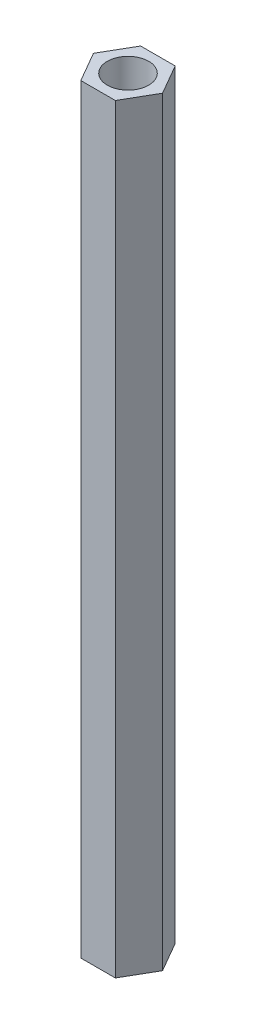
ISO-10303-21;
HEADER;
FILE_DESCRIPTION(('STEP AP214'),'2;1');
FILE_NAME('part.step','',(''),(''),'','','');
FILE_SCHEMA(('AUTOMOTIVE_DESIGN { 1 0 10303 214 1 1 1 1 }'));
ENDSEC;
DATA;
#1=APPLICATION_CONTEXT('core data for automotive mechanical design processes');
#2=APPLICATION_PROTOCOL_DEFINITION('international standard','automotive_design',2000,#1);
#3=PRODUCT_CONTEXT('',#1,'mechanical');
#4=PRODUCT('Part','Part','',(#3));
#5=PRODUCT_RELATED_PRODUCT_CATEGORY('part','',(#4));
#6=PRODUCT_DEFINITION_FORMATION('','',#4);
#7=PRODUCT_DEFINITION_CONTEXT('part definition',#1,'design');
#8=PRODUCT_DEFINITION('design','',#6,#7);
#9=PRODUCT_DEFINITION_SHAPE('','',#8);
#10=(LENGTH_UNIT() NAMED_UNIT(*) SI_UNIT(.MILLI.,.METRE.));
#11=(NAMED_UNIT(*) PLANE_ANGLE_UNIT() SI_UNIT($,.RADIAN.));
#12=(NAMED_UNIT(*) SI_UNIT($,.STERADIAN.) SOLID_ANGLE_UNIT());
#13=UNCERTAINTY_MEASURE_WITH_UNIT(LENGTH_MEASURE(1.E-05),#10,'distance_accuracy_value','');
#14=(GEOMETRIC_REPRESENTATION_CONTEXT(3) GLOBAL_UNCERTAINTY_ASSIGNED_CONTEXT((#13)) GLOBAL_UNIT_ASSIGNED_CONTEXT((#10,
#11,#12)) REPRESENTATION_CONTEXT('',''));
#15=CARTESIAN_POINT('',(0.,0.,0.));
#16=DIRECTION('',(0.,0.,1.));
#17=DIRECTION('',(1.,0.,0.));
#18=AXIS2_PLACEMENT_3D('',#15,#16,#17);
#19=CARTESIAN_POINT('',(0.,55.,0.));
#20=DIRECTION('',(0.,1.,0.));
#21=DIRECTION('',(0.,0.,1.));
#22=AXIS2_PLACEMENT_3D('',#19,#20,#21);
#23=PLANE('',#22);
#24=DIRECTION('',(-0.5,0.,0.866025403784439));
#25=VECTOR('',#24,1.);
#26=CARTESIAN_POINT('',(-1.25,55.,-2.1650635094611));
#27=LINE('',#26,#25);
#28=CARTESIAN_POINT('',(-1.25,55.,-2.1650635094611));
#29=VERTEX_POINT('',#28);
#30=CARTESIAN_POINT('',(-2.5,55.,0.));
#31=VERTEX_POINT('',#30);
#32=EDGE_CURVE('E130',#29,#31,#27,.T.);
#33=ORIENTED_EDGE('',*,*,#32,.T.);
#34=DIRECTION('',(0.5,0.,0.866025403784438));
#35=VECTOR('',#34,1.);
#36=CARTESIAN_POINT('',(-2.5,55.,0.));
#37=LINE('',#36,#35);
#38=CARTESIAN_POINT('',(-1.25,55.,2.1650635094611));
#39=VERTEX_POINT('',#38);
#40=EDGE_CURVE('E88',#31,#39,#37,.T.);
#41=ORIENTED_EDGE('',*,*,#40,.T.);
#42=DIRECTION('',(1.,0.,0.));
#43=VECTOR('',#42,1.);
#44=CARTESIAN_POINT('',(-1.25,55.,2.1650635094611));
#45=LINE('',#44,#43);
#46=CARTESIAN_POINT('',(1.25,55.,2.1650635094611));
#47=VERTEX_POINT('',#46);
#48=EDGE_CURVE('E101',#39,#47,#45,.T.);
#49=ORIENTED_EDGE('',*,*,#48,.T.);
#50=DIRECTION('',(0.5,0.,-0.866025403784439));
#51=VECTOR('',#50,1.);
#52=CARTESIAN_POINT('',(1.25,55.,2.1650635094611));
#53=LINE('',#52,#51);
#54=CARTESIAN_POINT('',(2.5,55.,0.));
#55=VERTEX_POINT('',#54);
#56=EDGE_CURVE('E95',#47,#55,#53,.T.);
#57=ORIENTED_EDGE('',*,*,#56,.T.);
#58=DIRECTION('',(-0.5,0.,-0.866025403784439));
#59=VECTOR('',#58,1.);
#60=CARTESIAN_POINT('',(2.5,55.,0.));
#61=LINE('',#60,#59);
#62=CARTESIAN_POINT('',(1.25,55.,-2.1650635094611));
#63=VERTEX_POINT('',#62);
#64=EDGE_CURVE('E99',#55,#63,#61,.T.);
#65=ORIENTED_EDGE('',*,*,#64,.T.);
#66=DIRECTION('',(-1.,0.,0.));
#67=VECTOR('',#66,1.);
#68=CARTESIAN_POINT('',(1.25,55.,-2.1650635094611));
#69=LINE('',#68,#67);
#70=EDGE_CURVE('E51',#63,#29,#69,.T.);
#71=ORIENTED_EDGE('',*,*,#70,.T.);
#72=EDGE_LOOP('',(#33,#41,#49,#57,#65,#71));
#73=FACE_BOUND('',#72,.T.);
#74=CARTESIAN_POINT('',(0.,55.,0.));
#75=DIRECTION('',(0.,1.,0.));
#76=DIRECTION('',(0.,0.,1.));
#77=AXIS2_PLACEMENT_3D('',#74,#75,#76);
#78=CIRCLE('',#77,1.5);
#79=CARTESIAN_POINT('',(0.,55.,1.5));
#80=VERTEX_POINT('',#79);
#81=EDGE_CURVE('E123',#80,#80,#78,.T.);
#82=ORIENTED_EDGE('',*,*,#81,.F.);
#83=EDGE_LOOP('',(#82));
#84=FACE_BOUND('',#83,.T.);
#85=ADVANCED_FACE('F34',(#73,#84),#23,.T.);
#86=CARTESIAN_POINT('',(0.,0.,0.));
#87=DIRECTION('',(0.,1.,0.));
#88=DIRECTION('',(0.,0.,1.));
#89=AXIS2_PLACEMENT_3D('',#86,#87,#88);
#90=PLANE('',#89);
#91=DIRECTION('',(-0.5,0.,0.866025403784439));
#92=VECTOR('',#91,1.);
#93=CARTESIAN_POINT('',(-1.25,0.,-2.1650635094611));
#94=LINE('',#93,#92);
#95=CARTESIAN_POINT('',(-1.25,0.,-2.1650635094611));
#96=VERTEX_POINT('',#95);
#97=CARTESIAN_POINT('',(-2.5,0.,0.));
#98=VERTEX_POINT('',#97);
#99=EDGE_CURVE('E119',#96,#98,#94,.T.);
#100=ORIENTED_EDGE('',*,*,#99,.F.);
#101=DIRECTION('',(-1.,0.,0.));
#102=VECTOR('',#101,1.);
#103=CARTESIAN_POINT('',(1.25,0.,-2.1650635094611));
#104=LINE('',#103,#102);
#105=CARTESIAN_POINT('',(1.25,0.,-2.1650635094611));
#106=VERTEX_POINT('',#105);
#107=EDGE_CURVE('E80',#106,#96,#104,.T.);
#108=ORIENTED_EDGE('',*,*,#107,.F.);
#109=DIRECTION('',(-0.5,0.,-0.866025403784439));
#110=VECTOR('',#109,1.);
#111=CARTESIAN_POINT('',(2.5,0.,0.));
#112=LINE('',#111,#110);
#113=CARTESIAN_POINT('',(2.5,0.,0.));
#114=VERTEX_POINT('',#113);
#115=EDGE_CURVE('E74',#114,#106,#112,.T.);
#116=ORIENTED_EDGE('',*,*,#115,.F.);
#117=DIRECTION('',(0.5,0.,-0.866025403784439));
#118=VECTOR('',#117,1.);
#119=CARTESIAN_POINT('',(1.25,0.,2.1650635094611));
#120=LINE('',#119,#118);
#121=CARTESIAN_POINT('',(1.25,0.,2.1650635094611));
#122=VERTEX_POINT('',#121);
#123=EDGE_CURVE('E109',#122,#114,#120,.T.);
#124=ORIENTED_EDGE('',*,*,#123,.F.);
#125=DIRECTION('',(1.,0.,0.));
#126=VECTOR('',#125,1.);
#127=CARTESIAN_POINT('',(-1.25,0.,2.1650635094611));
#128=LINE('',#127,#126);
#129=CARTESIAN_POINT('',(-1.25,0.,2.1650635094611));
#130=VERTEX_POINT('',#129);
#131=EDGE_CURVE('E125',#130,#122,#128,.T.);
#132=ORIENTED_EDGE('',*,*,#131,.F.);
#133=DIRECTION('',(0.5,0.,0.866025403784438));
#134=VECTOR('',#133,1.);
#135=CARTESIAN_POINT('',(-2.5,0.,0.));
#136=LINE('',#135,#134);
#137=EDGE_CURVE('E122',#98,#130,#136,.T.);
#138=ORIENTED_EDGE('',*,*,#137,.F.);
#139=EDGE_LOOP('',(#100,#108,#116,#124,#132,#138));
#140=FACE_BOUND('',#139,.T.);
#141=CARTESIAN_POINT('',(0.,0.,0.));
#142=DIRECTION('',(0.,1.,0.));
#143=DIRECTION('',(0.,0.,1.));
#144=AXIS2_PLACEMENT_3D('',#141,#142,#143);
#145=CIRCLE('',#144,1.5);
#146=CARTESIAN_POINT('',(0.,0.,1.5));
#147=VERTEX_POINT('',#146);
#148=EDGE_CURVE('E223',#147,#147,#145,.T.);
#149=ORIENTED_EDGE('',*,*,#148,.T.);
#150=EDGE_LOOP('',(#149));
#151=FACE_BOUND('',#150,.T.);
#152=ADVANCED_FACE('F139',(#140,#151),#90,.F.);
#153=CARTESIAN_POINT('',(-1.25,55.,-2.1650635094611));
#154=DIRECTION('',(0.866025403784439,0.,0.5));
#155=DIRECTION('',(0.5,0.,-0.866025403784439));
#156=AXIS2_PLACEMENT_3D('',#153,#154,#155);
#157=PLANE('',#156);
#158=ORIENTED_EDGE('',*,*,#99,.T.);
#159=DIRECTION('',(0.,-1.,0.));
#160=VECTOR('',#159,1.);
#161=CARTESIAN_POINT('',(-2.5,55.,0.));
#162=LINE('',#161,#160);
#163=EDGE_CURVE('E11',#31,#98,#162,.T.);
#164=ORIENTED_EDGE('',*,*,#163,.F.);
#165=ORIENTED_EDGE('',*,*,#32,.F.);
#166=DIRECTION('',(0.,-1.,0.));
#167=VECTOR('',#166,1.);
#168=CARTESIAN_POINT('',(-1.25,55.,-2.1650635094611));
#169=LINE('',#168,#167);
#170=EDGE_CURVE('E115',#29,#96,#169,.T.);
#171=ORIENTED_EDGE('',*,*,#170,.T.);
#172=EDGE_LOOP('',(#158,#164,#165,#171));
#173=FACE_BOUND('',#172,.T.);
#174=ADVANCED_FACE('F36',(#173),#157,.F.);
#175=CARTESIAN_POINT('',(-2.5,55.,0.));
#176=DIRECTION('',(0.866025403784439,0.,-0.5));
#177=DIRECTION('',(-0.5,0.,-0.866025403784439));
#178=AXIS2_PLACEMENT_3D('',#175,#176,#177);
#179=PLANE('',#178);
#180=ORIENTED_EDGE('',*,*,#137,.T.);
#181=DIRECTION('',(0.,-1.,0.));
#182=VECTOR('',#181,1.);
#183=CARTESIAN_POINT('',(-1.25,55.,2.1650635094611));
#184=LINE('',#183,#182);
#185=EDGE_CURVE('E43',#39,#130,#184,.T.);
#186=ORIENTED_EDGE('',*,*,#185,.F.);
#187=ORIENTED_EDGE('',*,*,#40,.F.);
#188=ORIENTED_EDGE('',*,*,#163,.T.);
#189=EDGE_LOOP('',(#180,#186,#187,#188));
#190=FACE_BOUND('',#189,.T.);
#191=ADVANCED_FACE('F164',(#190),#179,.F.);
#192=CARTESIAN_POINT('',(-1.25,55.,2.1650635094611));
#193=DIRECTION('',(0.,0.,-1.));
#194=DIRECTION('',(-1.,0.,0.));
#195=AXIS2_PLACEMENT_3D('',#192,#193,#194);
#196=PLANE('',#195);
#197=ORIENTED_EDGE('',*,*,#131,.T.);
#198=DIRECTION('',(0.,-1.,0.));
#199=VECTOR('',#198,1.);
#200=CARTESIAN_POINT('',(1.25,55.,2.1650635094611));
#201=LINE('',#200,#199);
#202=EDGE_CURVE('E110',#47,#122,#201,.T.);
#203=ORIENTED_EDGE('',*,*,#202,.F.);
#204=ORIENTED_EDGE('',*,*,#48,.F.);
#205=ORIENTED_EDGE('',*,*,#185,.T.);
#206=EDGE_LOOP('',(#197,#203,#204,#205));
#207=FACE_BOUND('',#206,.T.);
#208=ADVANCED_FACE('F136',(#207),#196,.F.);
#209=CARTESIAN_POINT('',(1.25,55.,2.1650635094611));
#210=DIRECTION('',(-0.866025403784439,0.,-0.5));
#211=DIRECTION('',(-0.5,0.,0.866025403784438));
#212=AXIS2_PLACEMENT_3D('',#209,#210,#211);
#213=PLANE('',#212);
#214=ORIENTED_EDGE('',*,*,#123,.T.);
#215=DIRECTION('',(0.,-1.,0.));
#216=VECTOR('',#215,1.);
#217=CARTESIAN_POINT('',(2.5,55.,0.));
#218=LINE('',#217,#216);
#219=EDGE_CURVE('E106',#55,#114,#218,.T.);
#220=ORIENTED_EDGE('',*,*,#219,.F.);
#221=ORIENTED_EDGE('',*,*,#56,.F.);
#222=ORIENTED_EDGE('',*,*,#202,.T.);
#223=EDGE_LOOP('',(#214,#220,#221,#222));
#224=FACE_BOUND('',#223,.T.);
#225=ADVANCED_FACE('F107',(#224),#213,.F.);
#226=CARTESIAN_POINT('',(2.5,55.,0.));
#227=DIRECTION('',(-0.866025403784439,0.,0.5));
#228=DIRECTION('',(0.5,0.,0.866025403784439));
#229=AXIS2_PLACEMENT_3D('',#226,#227,#228);
#230=PLANE('',#229);
#231=ORIENTED_EDGE('',*,*,#115,.T.);
#232=DIRECTION('',(0.,-1.,0.));
#233=VECTOR('',#232,1.);
#234=CARTESIAN_POINT('',(1.25,55.,-2.1650635094611));
#235=LINE('',#234,#233);
#236=EDGE_CURVE('E111',#63,#106,#235,.T.);
#237=ORIENTED_EDGE('',*,*,#236,.F.);
#238=ORIENTED_EDGE('',*,*,#64,.F.);
#239=ORIENTED_EDGE('',*,*,#219,.T.);
#240=EDGE_LOOP('',(#231,#237,#238,#239));
#241=FACE_BOUND('',#240,.T.);
#242=ADVANCED_FACE('F113',(#241),#230,.F.);
#243=CARTESIAN_POINT('',(1.25,55.,-2.1650635094611));
#244=DIRECTION('',(0.,0.,1.));
#245=DIRECTION('',(1.,0.,0.));
#246=AXIS2_PLACEMENT_3D('',#243,#244,#245);
#247=PLANE('',#246);
#248=ORIENTED_EDGE('',*,*,#107,.T.);
#249=ORIENTED_EDGE('',*,*,#170,.F.);
#250=ORIENTED_EDGE('',*,*,#70,.F.);
#251=ORIENTED_EDGE('',*,*,#236,.T.);
#252=EDGE_LOOP('',(#248,#249,#250,#251));
#253=FACE_BOUND('',#252,.T.);
#254=ADVANCED_FACE('F144',(#253),#247,.F.);
#255=CARTESIAN_POINT('',(0.,55.,0.));
#256=DIRECTION('',(0.,-1.,0.));
#257=DIRECTION('',(0.,0.,-1.));
#258=AXIS2_PLACEMENT_3D('',#255,#256,#257);
#259=CYLINDRICAL_SURFACE('',#258,1.5);
#260=ORIENTED_EDGE('',*,*,#81,.T.);
#261=EDGE_LOOP('',(#260));
#262=FACE_BOUND('',#261,.T.);
#263=ORIENTED_EDGE('',*,*,#148,.F.);
#264=EDGE_LOOP('',(#263));
#265=FACE_BOUND('',#264,.T.);
#266=ADVANCED_FACE('F146',(#262,#265),#259,.F.);
#267=CLOSED_SHELL('',(#85,#152,#174,#191,#208,#225,#242,#254,#266));
#268=MANIFOLD_SOLID_BREP('B2',#267);
#269=ADVANCED_BREP_SHAPE_REPRESENTATION('',(#18,#268),#14);
#270=SHAPE_DEFINITION_REPRESENTATION(#9,#269);
ENDSEC;
END-ISO-10303-21;
